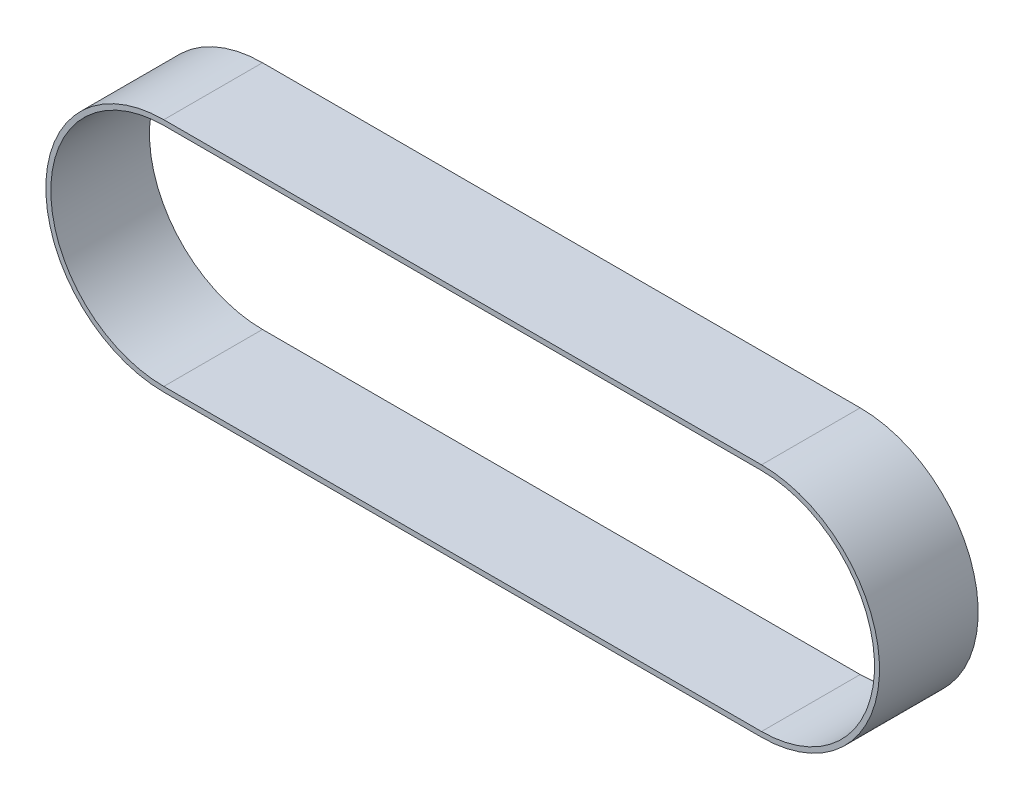
ISO-10303-21;
HEADER;
FILE_DESCRIPTION(('STEP AP214'),'2;1');
FILE_NAME('part.step','',(''),(''),'','','');
FILE_SCHEMA(('AUTOMOTIVE_DESIGN { 1 0 10303 214 1 1 1 1 }'));
ENDSEC;
DATA;
#1=APPLICATION_CONTEXT('core data for automotive mechanical design processes');
#2=APPLICATION_PROTOCOL_DEFINITION('international standard','automotive_design',2000,#1);
#3=PRODUCT_CONTEXT('',#1,'mechanical');
#4=PRODUCT('Part','Part','',(#3));
#5=PRODUCT_RELATED_PRODUCT_CATEGORY('part','',(#4));
#6=PRODUCT_DEFINITION_FORMATION('','',#4);
#7=PRODUCT_DEFINITION_CONTEXT('part definition',#1,'design');
#8=PRODUCT_DEFINITION('design','',#6,#7);
#9=PRODUCT_DEFINITION_SHAPE('','',#8);
#10=(LENGTH_UNIT() NAMED_UNIT(*) SI_UNIT(.MILLI.,.METRE.));
#11=(NAMED_UNIT(*) PLANE_ANGLE_UNIT() SI_UNIT($,.RADIAN.));
#12=(NAMED_UNIT(*) SI_UNIT($,.STERADIAN.) SOLID_ANGLE_UNIT());
#13=UNCERTAINTY_MEASURE_WITH_UNIT(LENGTH_MEASURE(1.E-05),#10,'distance_accuracy_value','');
#14=(GEOMETRIC_REPRESENTATION_CONTEXT(3) GLOBAL_UNCERTAINTY_ASSIGNED_CONTEXT((#13)) GLOBAL_UNIT_ASSIGNED_CONTEXT((#10,
#11,#12)) REPRESENTATION_CONTEXT('',''));
#15=CARTESIAN_POINT('',(0.,0.,0.));
#16=DIRECTION('',(0.,0.,1.));
#17=DIRECTION('',(1.,0.,0.));
#18=AXIS2_PLACEMENT_3D('',#15,#16,#17);
#19=CARTESIAN_POINT('',(120.015,22.68855,9.906));
#20=DIRECTION('',(0.,0.,-1.));
#21=DIRECTION('',(-1.,0.,0.));
#22=AXIS2_PLACEMENT_3D('',#19,#20,#21);
#23=PLANE('',#22);
#24=CARTESIAN_POINT('',(120.015,22.68855,9.906));
#25=DIRECTION('',(0.,0.,1.));
#26=DIRECTION('',(-1.,0.,0.));
#27=AXIS2_PLACEMENT_3D('',#24,#25,#26);
#28=CIRCLE('',#27,23.68855);
#29=CARTESIAN_POINT('',(120.015,-0.999999999999945,9.906));
#30=VERTEX_POINT('',#29);
#31=CARTESIAN_POINT('',(120.015,46.3771,9.906));
#32=VERTEX_POINT('',#31);
#33=EDGE_CURVE('E134',#30,#32,#28,.T.);
#34=ORIENTED_EDGE('',*,*,#33,.T.);
#35=DIRECTION('',(-1.,0.,0.));
#36=VECTOR('',#35,1.);
#37=CARTESIAN_POINT('',(0.,46.3771,9.906));
#38=LINE('',#37,#36);
#39=CARTESIAN_POINT('',(0.,46.3771,9.906));
#40=VERTEX_POINT('',#39);
#41=EDGE_CURVE('E137',#32,#40,#38,.T.);
#42=ORIENTED_EDGE('',*,*,#41,.T.);
#43=CARTESIAN_POINT('',(0.,22.68855,9.906));
#44=DIRECTION('',(0.,0.,1.));
#45=DIRECTION('',(1.,0.,0.));
#46=AXIS2_PLACEMENT_3D('',#43,#44,#45);
#47=CIRCLE('',#46,23.68855);
#48=CARTESIAN_POINT('',(0.,-0.999999999999997,9.906));
#49=VERTEX_POINT('',#48);
#50=EDGE_CURVE('E140',#40,#49,#47,.T.);
#51=ORIENTED_EDGE('',*,*,#50,.T.);
#52=DIRECTION('',(1.,0.,0.));
#53=VECTOR('',#52,1.);
#54=CARTESIAN_POINT('',(0.,-1.,9.906));
#55=LINE('',#54,#53);
#56=EDGE_CURVE('E142',#49,#30,#55,.T.);
#57=ORIENTED_EDGE('',*,*,#56,.T.);
#58=EDGE_LOOP('',(#34,#42,#51,#57));
#59=FACE_BOUND('',#58,.T.);
#60=CARTESIAN_POINT('',(120.015,22.68855,9.906));
#61=DIRECTION('',(0.,0.,1.));
#62=DIRECTION('',(-1.,0.,0.));
#63=AXIS2_PLACEMENT_3D('',#60,#61,#62);
#64=CIRCLE('',#63,22.68855);
#65=CARTESIAN_POINT('',(120.015,0.,9.906));
#66=VERTEX_POINT('',#65);
#67=CARTESIAN_POINT('',(120.015,45.3771,9.906));
#68=VERTEX_POINT('',#67);
#69=EDGE_CURVE('E98',#66,#68,#64,.T.);
#70=ORIENTED_EDGE('',*,*,#69,.F.);
#71=DIRECTION('',(1.,0.,0.));
#72=VECTOR('',#71,1.);
#73=CARTESIAN_POINT('',(0.,0.,9.906));
#74=LINE('',#73,#72);
#75=CARTESIAN_POINT('',(0.,0.,9.906));
#76=VERTEX_POINT('',#75);
#77=EDGE_CURVE('E120',#76,#66,#74,.T.);
#78=ORIENTED_EDGE('',*,*,#77,.F.);
#79=CARTESIAN_POINT('',(0.,22.68855,9.906));
#80=DIRECTION('',(0.,0.,1.));
#81=DIRECTION('',(1.,0.,0.));
#82=AXIS2_PLACEMENT_3D('',#79,#80,#81);
#83=CIRCLE('',#82,22.68855);
#84=CARTESIAN_POINT('',(0.,45.3771,9.906));
#85=VERTEX_POINT('',#84);
#86=EDGE_CURVE('E118',#85,#76,#83,.T.);
#87=ORIENTED_EDGE('',*,*,#86,.F.);
#88=DIRECTION('',(-1.,0.,0.));
#89=VECTOR('',#88,1.);
#90=CARTESIAN_POINT('',(0.,45.3771,9.906));
#91=LINE('',#90,#89);
#92=EDGE_CURVE('E106',#68,#85,#91,.T.);
#93=ORIENTED_EDGE('',*,*,#92,.F.);
#94=EDGE_LOOP('',(#70,#78,#87,#93));
#95=FACE_BOUND('',#94,.T.);
#96=ADVANCED_FACE('F33',(#59,#95),#23,.F.);
#97=CARTESIAN_POINT('',(120.015,22.68855,-9.906));
#98=DIRECTION('',(0.,0.,-1.));
#99=DIRECTION('',(-1.,0.,0.));
#100=AXIS2_PLACEMENT_3D('',#97,#98,#99);
#101=PLANE('',#100);
#102=CARTESIAN_POINT('',(120.015,22.68855,-9.906));
#103=DIRECTION('',(0.,0.,1.));
#104=DIRECTION('',(-1.,0.,0.));
#105=AXIS2_PLACEMENT_3D('',#102,#103,#104);
#106=CIRCLE('',#105,23.68855);
#107=CARTESIAN_POINT('',(120.015,-0.999999999999945,-9.906));
#108=VERTEX_POINT('',#107);
#109=CARTESIAN_POINT('',(120.015,46.3771,-9.906));
#110=VERTEX_POINT('',#109);
#111=EDGE_CURVE('E114',#108,#110,#106,.T.);
#112=ORIENTED_EDGE('',*,*,#111,.F.);
#113=DIRECTION('',(1.,0.,0.));
#114=VECTOR('',#113,1.);
#115=CARTESIAN_POINT('',(0.,-1.,-9.906));
#116=LINE('',#115,#114);
#117=CARTESIAN_POINT('',(0.,-0.999999999999997,-9.906));
#118=VERTEX_POINT('',#117);
#119=EDGE_CURVE('E138',#118,#108,#116,.T.);
#120=ORIENTED_EDGE('',*,*,#119,.F.);
#121=CARTESIAN_POINT('',(0.,22.68855,-9.906));
#122=DIRECTION('',(0.,0.,1.));
#123=DIRECTION('',(1.,0.,0.));
#124=AXIS2_PLACEMENT_3D('',#121,#122,#123);
#125=CIRCLE('',#124,23.68855);
#126=CARTESIAN_POINT('',(0.,46.3771,-9.906));
#127=VERTEX_POINT('',#126);
#128=EDGE_CURVE('E149',#127,#118,#125,.T.);
#129=ORIENTED_EDGE('',*,*,#128,.F.);
#130=DIRECTION('',(-1.,0.,0.));
#131=VECTOR('',#130,1.);
#132=CARTESIAN_POINT('',(0.,46.3771,-9.906));
#133=LINE('',#132,#131);
#134=EDGE_CURVE('E147',#110,#127,#133,.T.);
#135=ORIENTED_EDGE('',*,*,#134,.F.);
#136=EDGE_LOOP('',(#112,#120,#129,#135));
#137=FACE_BOUND('',#136,.T.);
#138=DIRECTION('',(1.,0.,0.));
#139=VECTOR('',#138,1.);
#140=CARTESIAN_POINT('',(0.,0.,-9.906));
#141=LINE('',#140,#139);
#142=CARTESIAN_POINT('',(0.,0.,-9.906));
#143=VERTEX_POINT('',#142);
#144=CARTESIAN_POINT('',(120.015,0.,-9.906));
#145=VERTEX_POINT('',#144);
#146=EDGE_CURVE('E107',#143,#145,#141,.T.);
#147=ORIENTED_EDGE('',*,*,#146,.T.);
#148=CARTESIAN_POINT('',(120.015,22.68855,-9.906));
#149=DIRECTION('',(0.,0.,1.));
#150=DIRECTION('',(-1.,0.,0.));
#151=AXIS2_PLACEMENT_3D('',#148,#149,#150);
#152=CIRCLE('',#151,22.68855);
#153=CARTESIAN_POINT('',(120.015,45.3771,-9.906));
#154=VERTEX_POINT('',#153);
#155=EDGE_CURVE('E56',#145,#154,#152,.T.);
#156=ORIENTED_EDGE('',*,*,#155,.T.);
#157=DIRECTION('',(-1.,0.,0.));
#158=VECTOR('',#157,1.);
#159=CARTESIAN_POINT('',(0.,45.3771,-9.906));
#160=LINE('',#159,#158);
#161=CARTESIAN_POINT('',(0.,45.3771,-9.906));
#162=VERTEX_POINT('',#161);
#163=EDGE_CURVE('E113',#154,#162,#160,.T.);
#164=ORIENTED_EDGE('',*,*,#163,.T.);
#165=CARTESIAN_POINT('',(0.,22.68855,-9.906));
#166=DIRECTION('',(0.,0.,1.));
#167=DIRECTION('',(1.,0.,0.));
#168=AXIS2_PLACEMENT_3D('',#165,#166,#167);
#169=CIRCLE('',#168,22.68855);
#170=EDGE_CURVE('E126',#162,#143,#169,.T.);
#171=ORIENTED_EDGE('',*,*,#170,.T.);
#172=EDGE_LOOP('',(#147,#156,#164,#171));
#173=FACE_BOUND('',#172,.T.);
#174=ADVANCED_FACE('F167',(#137,#173),#101,.T.);
#175=CARTESIAN_POINT('',(120.015,22.68855,9.906));
#176=DIRECTION('',(0.,0.,-1.));
#177=DIRECTION('',(-1.,0.,0.));
#178=AXIS2_PLACEMENT_3D('',#175,#176,#177);
#179=CYLINDRICAL_SURFACE('',#178,23.68855);
#180=ORIENTED_EDGE('',*,*,#111,.T.);
#181=DIRECTION('',(0.,0.,-1.));
#182=VECTOR('',#181,1.);
#183=CARTESIAN_POINT('',(120.015,46.3771,9.906));
#184=LINE('',#183,#182);
#185=EDGE_CURVE('E11',#32,#110,#184,.T.);
#186=ORIENTED_EDGE('',*,*,#185,.F.);
#187=ORIENTED_EDGE('',*,*,#33,.F.);
#188=DIRECTION('',(0.,0.,-1.));
#189=VECTOR('',#188,1.);
#190=CARTESIAN_POINT('',(120.015,-0.999999999999945,9.906));
#191=LINE('',#190,#189);
#192=EDGE_CURVE('E144',#30,#108,#191,.T.);
#193=ORIENTED_EDGE('',*,*,#192,.T.);
#194=EDGE_LOOP('',(#180,#186,#187,#193));
#195=FACE_BOUND('',#194,.T.);
#196=ADVANCED_FACE('F35',(#195),#179,.T.);
#197=CARTESIAN_POINT('',(0.,46.3771,9.906));
#198=DIRECTION('',(0.,-1.,0.));
#199=DIRECTION('',(0.,0.,-1.));
#200=AXIS2_PLACEMENT_3D('',#197,#198,#199);
#201=PLANE('',#200);
#202=ORIENTED_EDGE('',*,*,#134,.T.);
#203=DIRECTION('',(0.,0.,-1.));
#204=VECTOR('',#203,1.);
#205=CARTESIAN_POINT('',(0.,46.3771,9.906));
#206=LINE('',#205,#204);
#207=EDGE_CURVE('E41',#40,#127,#206,.T.);
#208=ORIENTED_EDGE('',*,*,#207,.F.);
#209=ORIENTED_EDGE('',*,*,#41,.F.);
#210=ORIENTED_EDGE('',*,*,#185,.T.);
#211=EDGE_LOOP('',(#202,#208,#209,#210));
#212=FACE_BOUND('',#211,.T.);
#213=ADVANCED_FACE('F177',(#212),#201,.F.);
#214=CARTESIAN_POINT('',(0.,22.68855,9.906));
#215=DIRECTION('',(0.,0.,-1.));
#216=DIRECTION('',(-1.,0.,0.));
#217=AXIS2_PLACEMENT_3D('',#214,#215,#216);
#218=CYLINDRICAL_SURFACE('',#217,23.68855);
#219=ORIENTED_EDGE('',*,*,#128,.T.);
#220=DIRECTION('',(0.,0.,-1.));
#221=VECTOR('',#220,1.);
#222=CARTESIAN_POINT('',(0.,-0.999999999999997,9.906));
#223=LINE('',#222,#221);
#224=EDGE_CURVE('E154',#49,#118,#223,.T.);
#225=ORIENTED_EDGE('',*,*,#224,.F.);
#226=ORIENTED_EDGE('',*,*,#50,.F.);
#227=ORIENTED_EDGE('',*,*,#207,.T.);
#228=EDGE_LOOP('',(#219,#225,#226,#227));
#229=FACE_BOUND('',#228,.T.);
#230=ADVANCED_FACE('F161',(#229),#218,.T.);
#231=CARTESIAN_POINT('',(0.,-1.,9.906));
#232=DIRECTION('',(0.,1.,0.));
#233=DIRECTION('',(-1.,0.,0.));
#234=AXIS2_PLACEMENT_3D('',#231,#232,#233);
#235=PLANE('',#234);
#236=ORIENTED_EDGE('',*,*,#119,.T.);
#237=ORIENTED_EDGE('',*,*,#192,.F.);
#238=ORIENTED_EDGE('',*,*,#56,.F.);
#239=ORIENTED_EDGE('',*,*,#224,.T.);
#240=EDGE_LOOP('',(#236,#237,#238,#239));
#241=FACE_BOUND('',#240,.T.);
#242=ADVANCED_FACE('F171',(#241),#235,.F.);
#243=CARTESIAN_POINT('',(120.015,22.68855,9.906));
#244=DIRECTION('',(0.,0.,-1.));
#245=DIRECTION('',(-1.,0.,0.));
#246=AXIS2_PLACEMENT_3D('',#243,#244,#245);
#247=CYLINDRICAL_SURFACE('',#246,22.68855);
#248=ORIENTED_EDGE('',*,*,#155,.F.);
#249=DIRECTION('',(0.,0.,-1.));
#250=VECTOR('',#249,1.);
#251=CARTESIAN_POINT('',(120.015,0.,9.906));
#252=LINE('',#251,#250);
#253=EDGE_CURVE('E102',#66,#145,#252,.T.);
#254=ORIENTED_EDGE('',*,*,#253,.F.);
#255=ORIENTED_EDGE('',*,*,#69,.T.);
#256=DIRECTION('',(0.,0.,-1.));
#257=VECTOR('',#256,1.);
#258=CARTESIAN_POINT('',(120.015,45.3771,9.906));
#259=LINE('',#258,#257);
#260=EDGE_CURVE('E101',#68,#154,#259,.T.);
#261=ORIENTED_EDGE('',*,*,#260,.T.);
#262=EDGE_LOOP('',(#248,#254,#255,#261));
#263=FACE_BOUND('',#262,.T.);
#264=ADVANCED_FACE('F100',(#263),#247,.F.);
#265=CARTESIAN_POINT('',(0.,45.3771,9.906));
#266=DIRECTION('',(0.,-1.,0.));
#267=DIRECTION('',(0.,0.,-1.));
#268=AXIS2_PLACEMENT_3D('',#265,#266,#267);
#269=PLANE('',#268);
#270=ORIENTED_EDGE('',*,*,#163,.F.);
#271=ORIENTED_EDGE('',*,*,#260,.F.);
#272=ORIENTED_EDGE('',*,*,#92,.T.);
#273=DIRECTION('',(0.,0.,-1.));
#274=VECTOR('',#273,1.);
#275=CARTESIAN_POINT('',(0.,45.3771,9.906));
#276=LINE('',#275,#274);
#277=EDGE_CURVE('E115',#85,#162,#276,.T.);
#278=ORIENTED_EDGE('',*,*,#277,.T.);
#279=EDGE_LOOP('',(#270,#271,#272,#278));
#280=FACE_BOUND('',#279,.T.);
#281=ADVANCED_FACE('F110',(#280),#269,.T.);
#282=CARTESIAN_POINT('',(0.,22.68855,9.906));
#283=DIRECTION('',(0.,0.,-1.));
#284=DIRECTION('',(-1.,0.,0.));
#285=AXIS2_PLACEMENT_3D('',#282,#283,#284);
#286=CYLINDRICAL_SURFACE('',#285,22.68855);
#287=ORIENTED_EDGE('',*,*,#170,.F.);
#288=ORIENTED_EDGE('',*,*,#277,.F.);
#289=ORIENTED_EDGE('',*,*,#86,.T.);
#290=DIRECTION('',(0.,0.,-1.));
#291=VECTOR('',#290,1.);
#292=CARTESIAN_POINT('',(0.,0.,9.906));
#293=LINE('',#292,#291);
#294=EDGE_CURVE('E48',#76,#143,#293,.T.);
#295=ORIENTED_EDGE('',*,*,#294,.T.);
#296=EDGE_LOOP('',(#287,#288,#289,#295));
#297=FACE_BOUND('',#296,.T.);
#298=ADVANCED_FACE('F200',(#297),#286,.F.);
#299=CARTESIAN_POINT('',(0.,0.,9.906));
#300=DIRECTION('',(0.,1.,0.));
#301=DIRECTION('',(0.,0.,1.));
#302=AXIS2_PLACEMENT_3D('',#299,#300,#301);
#303=PLANE('',#302);
#304=ORIENTED_EDGE('',*,*,#146,.F.);
#305=ORIENTED_EDGE('',*,*,#294,.F.);
#306=ORIENTED_EDGE('',*,*,#77,.T.);
#307=ORIENTED_EDGE('',*,*,#253,.T.);
#308=EDGE_LOOP('',(#304,#305,#306,#307));
#309=FACE_BOUND('',#308,.T.);
#310=ADVANCED_FACE('F204',(#309),#303,.T.);
#311=CLOSED_SHELL('',(#96,#174,#196,#213,#230,#242,#264,#281,#298,#310));
#312=MANIFOLD_SOLID_BREP('B2',#311);
#313=ADVANCED_BREP_SHAPE_REPRESENTATION('',(#18,#312),#14);
#314=SHAPE_DEFINITION_REPRESENTATION(#9,#313);
ENDSEC;
END-ISO-10303-21;
